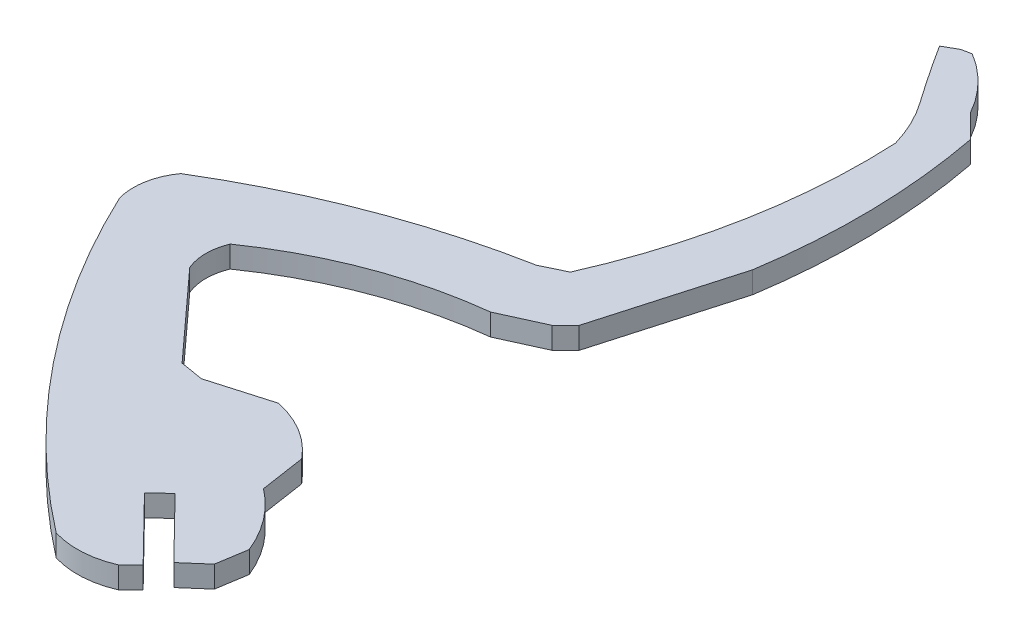
ISO-10303-21;
HEADER;
FILE_DESCRIPTION(('STEP AP214'),'2;1');
FILE_NAME('part.step','',(''),(''),'','','');
FILE_SCHEMA(('AUTOMOTIVE_DESIGN { 1 0 10303 214 1 1 1 1 }'));
ENDSEC;
DATA;
#1=APPLICATION_CONTEXT('core data for automotive mechanical design processes');
#2=APPLICATION_PROTOCOL_DEFINITION('international standard','automotive_design',2000,#1);
#3=PRODUCT_CONTEXT('',#1,'mechanical');
#4=PRODUCT('Part','Part','',(#3));
#5=PRODUCT_RELATED_PRODUCT_CATEGORY('part','',(#4));
#6=PRODUCT_DEFINITION_FORMATION('','',#4);
#7=PRODUCT_DEFINITION_CONTEXT('part definition',#1,'design');
#8=PRODUCT_DEFINITION('design','',#6,#7);
#9=PRODUCT_DEFINITION_SHAPE('','',#8);
#10=(LENGTH_UNIT() NAMED_UNIT(*) SI_UNIT(.MILLI.,.METRE.));
#11=(NAMED_UNIT(*) PLANE_ANGLE_UNIT() SI_UNIT($,.RADIAN.));
#12=(NAMED_UNIT(*) SI_UNIT($,.STERADIAN.) SOLID_ANGLE_UNIT());
#13=UNCERTAINTY_MEASURE_WITH_UNIT(LENGTH_MEASURE(1.E-05),#10,'distance_accuracy_value','');
#14=(GEOMETRIC_REPRESENTATION_CONTEXT(3) GLOBAL_UNCERTAINTY_ASSIGNED_CONTEXT((#13)) GLOBAL_UNIT_ASSIGNED_CONTEXT((#10,
#11,#12)) REPRESENTATION_CONTEXT('',''));
#15=CARTESIAN_POINT('',(0.,0.,0.));
#16=DIRECTION('',(0.,0.,1.));
#17=DIRECTION('',(1.,0.,0.));
#18=AXIS2_PLACEMENT_3D('',#15,#16,#17);
#19=CARTESIAN_POINT('',(-7.41712116409151,2.,-632.365573769868));
#20=DIRECTION('',(0.,-1.,0.));
#21=DIRECTION('',(0.,0.,-1.));
#22=AXIS2_PLACEMENT_3D('',#19,#20,#21);
#23=CYLINDRICAL_SURFACE('',#22,5.65555182550003);
#24=CARTESIAN_POINT('',(-7.41712116409151,0.,-632.365573769868));
#25=DIRECTION('',(0.,1.,0.));
#26=DIRECTION('',(0.,0.,1.));
#27=AXIS2_PLACEMENT_3D('',#24,#25,#26);
#28=CIRCLE('',#27,5.65555182550003);
#29=CARTESIAN_POINT('',(-12.0037899999994,0.,-635.674310000006));
#30=VERTEX_POINT('',#29);
#31=CARTESIAN_POINT('',(-12.8890900000413,0.,-630.936299999972));
#32=VERTEX_POINT('',#31);
#33=EDGE_CURVE('E11',#30,#32,#28,.T.);
#34=ORIENTED_EDGE('',*,*,#33,.T.);
#35=DIRECTION('',(0.,-1.,0.));
#36=VECTOR('',#35,1.);
#37=CARTESIAN_POINT('',(-12.8890900000413,2.,-630.936299999972));
#38=LINE('',#37,#36);
#39=CARTESIAN_POINT('',(-12.8890900000413,2.,-630.936299999972));
#40=VERTEX_POINT('',#39);
#41=EDGE_CURVE('E576',#40,#32,#38,.T.);
#42=ORIENTED_EDGE('',*,*,#41,.F.);
#43=CARTESIAN_POINT('',(-7.41712116409151,2.,-632.365573769868));
#44=DIRECTION('',(0.,1.,0.));
#45=DIRECTION('',(0.,0.,1.));
#46=AXIS2_PLACEMENT_3D('',#43,#44,#45);
#47=CIRCLE('',#46,5.65555182550003);
#48=CARTESIAN_POINT('',(-12.0037899999994,2.,-635.674310000006));
#49=VERTEX_POINT('',#48);
#50=EDGE_CURVE('E41',#49,#40,#47,.T.);
#51=ORIENTED_EDGE('',*,*,#50,.F.);
#52=DIRECTION('',(0.,-1.,0.));
#53=VECTOR('',#52,1.);
#54=CARTESIAN_POINT('',(-12.0037899999994,2.,-635.674310000006));
#55=LINE('',#54,#53);
#56=EDGE_CURVE('E273',#49,#30,#55,.T.);
#57=ORIENTED_EDGE('',*,*,#56,.T.);
#58=EDGE_LOOP('',(#34,#42,#51,#57));
#59=FACE_BOUND('',#58,.T.);
#60=ADVANCED_FACE('F37',(#59),#23,.T.);
#61=CARTESIAN_POINT('',(60.3970241386918,2.,-665.307077304684));
#62=DIRECTION('',(0.,-1.,0.));
#63=DIRECTION('',(0.,0.,-1.));
#64=AXIS2_PLACEMENT_3D('',#61,#62,#63);
#65=CYLINDRICAL_SURFACE('',#64,80.9456907938);
#66=CARTESIAN_POINT('',(60.3970241386918,0.,-665.307077304684));
#67=DIRECTION('',(0.,1.,0.));
#68=DIRECTION('',(0.,0.,1.));
#69=AXIS2_PLACEMENT_3D('',#66,#67,#68);
#70=CIRCLE('',#69,80.9456907938);
#71=CARTESIAN_POINT('',(10.9651200000634,0.,-601.207999999976));
#72=VERTEX_POINT('',#71);
#73=EDGE_CURVE('E47',#32,#72,#70,.T.);
#74=ORIENTED_EDGE('',*,*,#73,.T.);
#75=DIRECTION('',(0.,-1.,0.));
#76=VECTOR('',#75,1.);
#77=CARTESIAN_POINT('',(10.9651200000634,2.,-601.207999999976));
#78=LINE('',#77,#76);
#79=CARTESIAN_POINT('',(10.9651200000634,2.,-601.207999999976));
#80=VERTEX_POINT('',#79);
#81=EDGE_CURVE('E249',#80,#72,#78,.T.);
#82=ORIENTED_EDGE('',*,*,#81,.F.);
#83=CARTESIAN_POINT('',(60.3970241386918,2.,-665.307077304684));
#84=DIRECTION('',(0.,1.,0.));
#85=DIRECTION('',(0.,0.,1.));
#86=AXIS2_PLACEMENT_3D('',#83,#84,#85);
#87=CIRCLE('',#86,80.9456907938);
#88=EDGE_CURVE('E149',#40,#80,#87,.T.);
#89=ORIENTED_EDGE('',*,*,#88,.F.);
#90=ORIENTED_EDGE('',*,*,#41,.T.);
#91=EDGE_LOOP('',(#74,#82,#89,#90));
#92=FACE_BOUND('',#91,.T.);
#93=ADVANCED_FACE('F577',(#92),#65,.T.);
#94=CARTESIAN_POINT('',(13.2541401092692,2.,-608.74506000633));
#95=DIRECTION('',(0.,-1.,0.));
#96=DIRECTION('',(0.,0.,-1.));
#97=AXIS2_PLACEMENT_3D('',#94,#95,#96);
#98=CYLINDRICAL_SURFACE('',#97,7.87698461340009);
#99=CARTESIAN_POINT('',(13.2541401092692,0.,-608.74506000633));
#100=DIRECTION('',(0.,1.,0.));
#101=DIRECTION('',(0.,0.,1.));
#102=AXIS2_PLACEMENT_3D('',#99,#100,#101);
#103=CIRCLE('',#102,7.87698461340009);
#104=CARTESIAN_POINT('',(16.4009799999685,0.,-601.523959999957));
#105=VERTEX_POINT('',#104);
#106=EDGE_CURVE('E243',#72,#105,#103,.T.);
#107=ORIENTED_EDGE('',*,*,#106,.T.);
#108=DIRECTION('',(0.,-1.,0.));
#109=VECTOR('',#108,1.);
#110=CARTESIAN_POINT('',(16.4009799999685,2.,-601.523959999957));
#111=LINE('',#110,#109);
#112=CARTESIAN_POINT('',(16.4009799999685,2.,-601.523959999957));
#113=VERTEX_POINT('',#112);
#114=EDGE_CURVE('E247',#113,#105,#111,.T.);
#115=ORIENTED_EDGE('',*,*,#114,.F.);
#116=CARTESIAN_POINT('',(13.2541401092692,2.,-608.74506000633));
#117=DIRECTION('',(0.,1.,0.));
#118=DIRECTION('',(0.,0.,1.));
#119=AXIS2_PLACEMENT_3D('',#116,#117,#118);
#120=CIRCLE('',#119,7.87698461340009);
#121=EDGE_CURVE('E328',#80,#113,#120,.T.);
#122=ORIENTED_EDGE('',*,*,#121,.F.);
#123=ORIENTED_EDGE('',*,*,#81,.T.);
#124=EDGE_LOOP('',(#107,#115,#122,#123));
#125=FACE_BOUND('',#124,.T.);
#126=ADVANCED_FACE('F245',(#125),#98,.T.);
#127=CARTESIAN_POINT('',(-269.617106965875,2.,-315.709467880077));
#128=DIRECTION('',(-0.70685497861246,0.,-0.707358494124993));
#129=DIRECTION('',(-0.707358494124993,0.,0.70685497861246));
#130=AXIS2_PLACEMENT_3D('',#127,#128,#129);
#131=PLANE('',#130);
#132=DIRECTION('',(0.707358494124993,0.,-0.70685497861246));
#133=VECTOR('',#132,1.);
#134=CARTESIAN_POINT('',(-269.617106965875,0.,-315.709467880077));
#135=LINE('',#134,#133);
#136=CARTESIAN_POINT('',(17.5389,0.,-602.66107));
#137=VERTEX_POINT('',#136);
#138=EDGE_CURVE('E251',#105,#137,#135,.T.);
#139=ORIENTED_EDGE('',*,*,#138,.T.);
#140=DIRECTION('',(0.,-1.,0.));
#141=VECTOR('',#140,1.);
#142=CARTESIAN_POINT('',(17.5389,2.,-602.66107));
#143=LINE('',#142,#141);
#144=CARTESIAN_POINT('',(17.5389,2.,-602.66107));
#145=VERTEX_POINT('',#144);
#146=EDGE_CURVE('E258',#145,#137,#143,.T.);
#147=ORIENTED_EDGE('',*,*,#146,.F.);
#148=DIRECTION('',(0.707358494124993,0.,-0.70685497861246));
#149=VECTOR('',#148,1.);
#150=CARTESIAN_POINT('',(-269.617106965875,2.,-315.709467880077));
#151=LINE('',#150,#149);
#152=EDGE_CURVE('E257',#113,#145,#151,.T.);
#153=ORIENTED_EDGE('',*,*,#152,.F.);
#154=ORIENTED_EDGE('',*,*,#114,.T.);
#155=EDGE_LOOP('',(#139,#147,#153,#154));
#156=FACE_BOUND('',#155,.T.);
#157=ADVANCED_FACE('F254',(#156),#131,.F.);
#158=CARTESIAN_POINT('',(-233.121226608916,2.,-858.720331070032));
#159=DIRECTION('',(-0.714600495511536,0.,0.699532795381794));
#160=DIRECTION('',(0.699532795381794,0.,0.714600495511536));
#161=AXIS2_PLACEMENT_3D('',#158,#159,#160);
#162=PLANE('',#161);
#163=DIRECTION('',(-0.699532795381794,0.,-0.714600495511536));
#164=VECTOR('',#163,1.);
#165=CARTESIAN_POINT('',(-233.121226608916,0.,-858.720331070032));
#166=LINE('',#165,#164);
#167=CARTESIAN_POINT('',(11.8498600000001,0.,-608.47265));
#168=VERTEX_POINT('',#167);
#169=EDGE_CURVE('E263',#137,#168,#166,.T.);
#170=ORIENTED_EDGE('',*,*,#169,.T.);
#171=DIRECTION('',(0.,-1.,0.));
#172=VECTOR('',#171,1.);
#173=CARTESIAN_POINT('',(11.8498600000001,2.,-608.47265));
#174=LINE('',#173,#172);
#175=CARTESIAN_POINT('',(11.8498600000001,2.,-608.47265));
#176=VERTEX_POINT('',#175);
#177=EDGE_CURVE('E395',#176,#168,#174,.T.);
#178=ORIENTED_EDGE('',*,*,#177,.F.);
#179=DIRECTION('',(-0.699532795381794,0.,-0.714600495511536));
#180=VECTOR('',#179,1.);
#181=CARTESIAN_POINT('',(-233.121226608916,2.,-858.720331070032));
#182=LINE('',#181,#180);
#183=EDGE_CURVE('E325',#145,#176,#182,.T.);
#184=ORIENTED_EDGE('',*,*,#183,.F.);
#185=ORIENTED_EDGE('',*,*,#146,.T.);
#186=EDGE_LOOP('',(#170,#178,#184,#185));
#187=FACE_BOUND('',#186,.T.);
#188=ADVANCED_FACE('F571',(#187),#162,.F.);
#189=CARTESIAN_POINT('',(-288.037886309295,2.,-322.628257675503));
#190=DIRECTION('',(-0.689955105026955,0.,-0.723852162424928));
#191=DIRECTION('',(-0.723852162424928,0.,0.689955105026955));
#192=AXIS2_PLACEMENT_3D('',#189,#190,#191);
#193=PLANE('',#192);
#194=DIRECTION('',(0.723852162424928,0.,-0.689955105026955));
#195=VECTOR('',#194,1.);
#196=CARTESIAN_POINT('',(-288.037886309295,0.,-322.628257675503));
#197=LINE('',#196,#195);
#198=CARTESIAN_POINT('',(13.29769,0.,-609.85268));
#199=VERTEX_POINT('',#198);
#200=EDGE_CURVE('E265',#168,#199,#197,.T.);
#201=ORIENTED_EDGE('',*,*,#200,.T.);
#202=DIRECTION('',(0.,-1.,0.));
#203=VECTOR('',#202,1.);
#204=CARTESIAN_POINT('',(13.29769,2.,-609.85268));
#205=LINE('',#204,#203);
#206=CARTESIAN_POINT('',(13.29769,2.,-609.85268));
#207=VERTEX_POINT('',#206);
#208=EDGE_CURVE('E392',#207,#199,#205,.T.);
#209=ORIENTED_EDGE('',*,*,#208,.F.);
#210=DIRECTION('',(0.723852162424928,0.,-0.689955105026955));
#211=VECTOR('',#210,1.);
#212=CARTESIAN_POINT('',(-288.037886309295,2.,-322.628257675503));
#213=LINE('',#212,#211);
#214=EDGE_CURVE('E323',#176,#207,#213,.T.);
#215=ORIENTED_EDGE('',*,*,#214,.F.);
#216=ORIENTED_EDGE('',*,*,#177,.T.);
#217=EDGE_LOOP('',(#201,#209,#215,#216));
#218=FACE_BOUND('',#217,.T.);
#219=ADVANCED_FACE('F390',(#218),#193,.F.);
#220=CARTESIAN_POINT('',(-231.692271920994,2.,-860.119416323499));
#221=DIRECTION('',(0.714600178856164,0.,-0.699533118857669));
#222=DIRECTION('',(-0.69953311885767,0.,-0.714600178856164));
#223=AXIS2_PLACEMENT_3D('',#220,#221,#222);
#224=PLANE('',#223);
#225=DIRECTION('',(0.69953311885767,0.,0.714600178856164));
#226=VECTOR('',#225,1.);
#227=CARTESIAN_POINT('',(-231.692271920994,0.,-860.119416323499));
#228=LINE('',#227,#226);
#229=CARTESIAN_POINT('',(18.7673700000001,0.,-604.26519));
#230=VERTEX_POINT('',#229);
#231=EDGE_CURVE('E385',#199,#230,#228,.T.);
#232=ORIENTED_EDGE('',*,*,#231,.T.);
#233=DIRECTION('',(0.,-1.,0.));
#234=VECTOR('',#233,1.);
#235=CARTESIAN_POINT('',(18.7673700000001,2.,-604.26519));
#236=LINE('',#235,#234);
#237=CARTESIAN_POINT('',(18.7673700000001,2.,-604.26519));
#238=VERTEX_POINT('',#237);
#239=EDGE_CURVE('E401',#238,#230,#236,.T.);
#240=ORIENTED_EDGE('',*,*,#239,.F.);
#241=DIRECTION('',(0.69953311885767,0.,0.714600178856164));
#242=VECTOR('',#241,1.);
#243=CARTESIAN_POINT('',(-231.692271920994,2.,-860.119416323499));
#244=LINE('',#243,#242);
#245=EDGE_CURVE('E321',#207,#238,#244,.T.);
#246=ORIENTED_EDGE('',*,*,#245,.F.);
#247=ORIENTED_EDGE('',*,*,#208,.T.);
#248=EDGE_LOOP('',(#232,#240,#246,#247));
#249=FACE_BOUND('',#248,.T.);
#250=ADVANCED_FACE('F398',(#249),#224,.F.);
#251=CARTESIAN_POINT('',(-305.899341705349,2.,-320.483049296611));
#252=DIRECTION('',(-0.65810886303798,0.,-0.752922787801549));
#253=DIRECTION('',(-0.752922787801549,0.,0.65810886303798));
#254=AXIS2_PLACEMENT_3D('',#251,#252,#253);
#255=PLANE('',#254);
#256=DIRECTION('',(0.752922787801549,0.,-0.65810886303798));
#257=VECTOR('',#256,1.);
#258=CARTESIAN_POINT('',(-305.899341705349,0.,-320.483049296611));
#259=LINE('',#258,#257);
#260=CARTESIAN_POINT('',(20.76264,0.,-606.0092));
#261=VERTEX_POINT('',#260);
#262=EDGE_CURVE('E383',#230,#261,#259,.T.);
#263=ORIENTED_EDGE('',*,*,#262,.T.);
#264=DIRECTION('',(0.,-1.,0.));
#265=VECTOR('',#264,1.);
#266=CARTESIAN_POINT('',(20.76264,2.,-606.0092));
#267=LINE('',#266,#265);
#268=CARTESIAN_POINT('',(20.76264,2.,-606.0092));
#269=VERTEX_POINT('',#268);
#270=EDGE_CURVE('E411',#269,#261,#267,.T.);
#271=ORIENTED_EDGE('',*,*,#270,.F.);
#272=DIRECTION('',(0.752922787801549,0.,-0.65810886303798));
#273=VECTOR('',#272,1.);
#274=CARTESIAN_POINT('',(-305.899341705349,2.,-320.483049296611));
#275=LINE('',#274,#273);
#276=EDGE_CURVE('E319',#238,#269,#275,.T.);
#277=ORIENTED_EDGE('',*,*,#276,.F.);
#278=ORIENTED_EDGE('',*,*,#239,.T.);
#279=EDGE_LOOP('',(#263,#271,#277,#278));
#280=FACE_BOUND('',#279,.T.);
#281=ADVANCED_FACE('F409',(#280),#255,.F.);
#282=CARTESIAN_POINT('',(1.98100709377635,2.,-488.078875102483));
#283=DIRECTION('',(-0.987554318458287,0.,-0.157278314126225));
#284=DIRECTION('',(-0.157278314126225,0.,0.987554318458287));
#285=AXIS2_PLACEMENT_3D('',#282,#283,#284);
#286=PLANE('',#285);
#287=DIRECTION('',(0.157278314126225,0.,-0.987554318458287));
#288=VECTOR('',#287,1.);
#289=CARTESIAN_POINT('',(1.98100709377635,0.,-488.078875102483));
#290=LINE('',#289,#288);
#291=CARTESIAN_POINT('',(21.20529,0.,-608.78861));
#292=VERTEX_POINT('',#291);
#293=EDGE_CURVE('E381',#261,#292,#290,.T.);
#294=ORIENTED_EDGE('',*,*,#293,.T.);
#295=DIRECTION('',(0.,-1.,0.));
#296=VECTOR('',#295,1.);
#297=CARTESIAN_POINT('',(21.20529,2.,-608.78861));
#298=LINE('',#297,#296);
#299=CARTESIAN_POINT('',(21.20529,2.,-608.78861));
#300=VERTEX_POINT('',#299);
#301=EDGE_CURVE('E417',#300,#292,#298,.T.);
#302=ORIENTED_EDGE('',*,*,#301,.F.);
#303=DIRECTION('',(0.157278314126225,0.,-0.987554318458287));
#304=VECTOR('',#303,1.);
#305=CARTESIAN_POINT('',(1.98100709377635,2.,-488.078875102483));
#306=LINE('',#305,#304);
#307=EDGE_CURVE('E317',#269,#300,#306,.T.);
#308=ORIENTED_EDGE('',*,*,#307,.F.);
#309=ORIENTED_EDGE('',*,*,#270,.T.);
#310=EDGE_LOOP('',(#294,#302,#308,#309));
#311=FACE_BOUND('',#310,.T.);
#312=ADVANCED_FACE('F414',(#311),#286,.F.);
#313=CARTESIAN_POINT('',(9.06553161632329,2.,-603.896127879082));
#314=DIRECTION('',(0.,-1.,0.));
#315=DIRECTION('',(0.,0.,-1.));
#316=AXIS2_PLACEMENT_3D('',#313,#314,#315);
#317=CYLINDRICAL_SURFACE('',#316,13.0885489997);
#318=CARTESIAN_POINT('',(9.06553161632329,0.,-603.896127879082));
#319=DIRECTION('',(0.,1.,0.));
#320=DIRECTION('',(0.,0.,1.));
#321=AXIS2_PLACEMENT_3D('',#318,#319,#320);
#322=CIRCLE('',#321,13.0885489997);
#323=CARTESIAN_POINT('',(17.0021199999968,0.,-614.303849999974));
#324=VERTEX_POINT('',#323);
#325=EDGE_CURVE('E379',#292,#324,#322,.T.);
#326=ORIENTED_EDGE('',*,*,#325,.T.);
#327=DIRECTION('',(0.,-1.,0.));
#328=VECTOR('',#327,1.);
#329=CARTESIAN_POINT('',(17.0021199999968,2.,-614.303849999974));
#330=LINE('',#329,#328);
#331=CARTESIAN_POINT('',(17.0021199999968,2.,-614.303849999974));
#332=VERTEX_POINT('',#331);
#333=EDGE_CURVE('E419',#332,#324,#330,.T.);
#334=ORIENTED_EDGE('',*,*,#333,.F.);
#335=CARTESIAN_POINT('',(9.06553161632329,2.,-603.896127879082));
#336=DIRECTION('',(0.,1.,0.));
#337=DIRECTION('',(0.,0.,1.));
#338=AXIS2_PLACEMENT_3D('',#335,#336,#337);
#339=CIRCLE('',#338,13.0885489997);
#340=EDGE_CURVE('E315',#300,#332,#339,.T.);
#341=ORIENTED_EDGE('',*,*,#340,.F.);
#342=ORIENTED_EDGE('',*,*,#301,.T.);
#343=EDGE_LOOP('',(#326,#334,#341,#342));
#344=FACE_BOUND('',#343,.T.);
#345=ADVANCED_FACE('F568',(#344),#317,.T.);
#346=CARTESIAN_POINT('',(11.2084777681841,2.,-652.856342310851));
#347=DIRECTION('',(-0.988895795304989,0.,0.14861058518192));
#348=DIRECTION('',(0.14861058518192,0.,0.988895795304989));
#349=AXIS2_PLACEMENT_3D('',#346,#347,#348);
#350=PLANE('',#349);
#351=DIRECTION('',(-0.14861058518192,0.,-0.988895795304989));
#352=VECTOR('',#351,1.);
#353=CARTESIAN_POINT('',(11.2084777681841,0.,-652.856342310851));
#354=LINE('',#353,#352);
#355=CARTESIAN_POINT('',(16.3788200000001,0.,-618.45146));
#356=VERTEX_POINT('',#355);
#357=EDGE_CURVE('E377',#324,#356,#354,.T.);
#358=ORIENTED_EDGE('',*,*,#357,.T.);
#359=DIRECTION('',(0.,-1.,0.));
#360=VECTOR('',#359,1.);
#361=CARTESIAN_POINT('',(16.3788200000001,2.,-618.45146));
#362=LINE('',#361,#360);
#363=CARTESIAN_POINT('',(16.3788200000001,2.,-618.45146));
#364=VERTEX_POINT('',#363);
#365=EDGE_CURVE('E425',#364,#356,#362,.T.);
#366=ORIENTED_EDGE('',*,*,#365,.F.);
#367=DIRECTION('',(-0.14861058518192,0.,-0.988895795304989));
#368=VECTOR('',#367,1.);
#369=CARTESIAN_POINT('',(11.2084777681841,2.,-652.856342310851));
#370=LINE('',#369,#368);
#371=EDGE_CURVE('E313',#332,#364,#370,.T.);
#372=ORIENTED_EDGE('',*,*,#371,.F.);
#373=ORIENTED_EDGE('',*,*,#333,.T.);
#374=EDGE_LOOP('',(#358,#366,#372,#373));
#375=FACE_BOUND('',#374,.T.);
#376=ADVANCED_FACE('F564',(#375),#350,.F.);
#377=CARTESIAN_POINT('',(8.89434167467395,2.,-612.425588974205));
#378=DIRECTION('',(0.,-1.,0.));
#379=DIRECTION('',(0.,0.,-1.));
#380=AXIS2_PLACEMENT_3D('',#377,#378,#379);
#381=CYLINDRICAL_SURFACE('',#380,9.60877398120005);
#382=CARTESIAN_POINT('',(8.89434167467395,0.,-612.425588974205));
#383=DIRECTION('',(0.,1.,0.));
#384=DIRECTION('',(0.,0.,1.));
#385=AXIS2_PLACEMENT_3D('',#382,#383,#384);
#386=CIRCLE('',#385,9.60877398120005);
#387=CARTESIAN_POINT('',(10.8615200000106,0.,-621.830839999995));
#388=VERTEX_POINT('',#387);
#389=EDGE_CURVE('E375',#356,#388,#386,.T.);
#390=ORIENTED_EDGE('',*,*,#389,.T.);
#391=DIRECTION('',(0.,-1.,0.));
#392=VECTOR('',#391,1.);
#393=CARTESIAN_POINT('',(10.8615200000106,2.,-621.830839999995));
#394=LINE('',#393,#392);
#395=CARTESIAN_POINT('',(10.8615200000106,2.,-621.830839999995));
#396=VERTEX_POINT('',#395);
#397=EDGE_CURVE('E428',#396,#388,#394,.T.);
#398=ORIENTED_EDGE('',*,*,#397,.F.);
#399=CARTESIAN_POINT('',(8.89434167467395,2.,-612.425588974205));
#400=DIRECTION('',(0.,1.,0.));
#401=DIRECTION('',(0.,0.,1.));
#402=AXIS2_PLACEMENT_3D('',#399,#400,#401);
#403=CIRCLE('',#402,9.60877398120005);
#404=EDGE_CURVE('E311',#364,#396,#403,.T.);
#405=ORIENTED_EDGE('',*,*,#404,.F.);
#406=ORIENTED_EDGE('',*,*,#365,.T.);
#407=EDGE_LOOP('',(#390,#398,#405,#406));
#408=FACE_BOUND('',#407,.T.);
#409=ADVANCED_FACE('F559',(#408),#381,.T.);
#410=CARTESIAN_POINT('',(-497.487342414634,2.,-474.32835066889));
#411=DIRECTION('',(0.278666159923199,0.,0.960388031638076));
#412=DIRECTION('',(0.960388031638076,0.,-0.278666159923199));
#413=AXIS2_PLACEMENT_3D('',#410,#411,#412);
#414=PLANE('',#413);
#415=DIRECTION('',(-0.960388031638076,0.,0.278666159923199));
#416=VECTOR('',#415,1.);
#417=CARTESIAN_POINT('',(-497.487342414634,0.,-474.32835066889));
#418=LINE('',#417,#416);
#419=CARTESIAN_POINT('',(5.34477,0.,-620.2301));
#420=VERTEX_POINT('',#419);
#421=EDGE_CURVE('E373',#388,#420,#418,.T.);
#422=ORIENTED_EDGE('',*,*,#421,.T.);
#423=DIRECTION('',(0.,-1.,0.));
#424=VECTOR('',#423,1.);
#425=CARTESIAN_POINT('',(5.34477,2.,-620.2301));
#426=LINE('',#425,#424);
#427=CARTESIAN_POINT('',(5.34477,2.,-620.2301));
#428=VERTEX_POINT('',#427);
#429=EDGE_CURVE('E431',#428,#420,#426,.T.);
#430=ORIENTED_EDGE('',*,*,#429,.F.);
#431=DIRECTION('',(-0.960388031638076,0.,0.278666159923199));
#432=VECTOR('',#431,1.);
#433=CARTESIAN_POINT('',(-497.487342414634,2.,-474.32835066889));
#434=LINE('',#433,#432);
#435=EDGE_CURVE('E309',#396,#428,#434,.T.);
#436=ORIENTED_EDGE('',*,*,#435,.F.);
#437=ORIENTED_EDGE('',*,*,#397,.T.);
#438=EDGE_LOOP('',(#422,#430,#436,#437));
#439=FACE_BOUND('',#438,.T.);
#440=ADVANCED_FACE('F554',(#439),#414,.F.);
#441=CARTESIAN_POINT('',(-503.729289510095,2.,-705.041213315119));
#442=DIRECTION('',(-0.164333825637548,0.,0.986404781898044));
#443=DIRECTION('',(0.986404781898044,0.,0.164333825637548));
#444=AXIS2_PLACEMENT_3D('',#441,#442,#443);
#445=PLANE('',#444);
#446=DIRECTION('',(-0.986404781898044,0.,-0.164333825637548));
#447=VECTOR('',#446,1.);
#448=CARTESIAN_POINT('',(-503.729289510095,0.,-705.041213315119));
#449=LINE('',#448,#447);
#450=CARTESIAN_POINT('',(3.20910000000008,0.,-620.5859));
#451=VERTEX_POINT('',#450);
#452=EDGE_CURVE('E371',#420,#451,#449,.T.);
#453=ORIENTED_EDGE('',*,*,#452,.T.);
#454=DIRECTION('',(0.,-1.,0.));
#455=VECTOR('',#454,1.);
#456=CARTESIAN_POINT('',(3.20910000000008,2.,-620.5859));
#457=LINE('',#456,#455);
#458=CARTESIAN_POINT('',(3.20910000000008,2.,-620.5859));
#459=VERTEX_POINT('',#458);
#460=EDGE_CURVE('E434',#459,#451,#457,.T.);
#461=ORIENTED_EDGE('',*,*,#460,.F.);
#462=DIRECTION('',(-0.986404781898044,0.,-0.164333825637548));
#463=VECTOR('',#462,1.);
#464=CARTESIAN_POINT('',(-503.729289510095,2.,-705.041213315119));
#465=LINE('',#464,#463);
#466=EDGE_CURVE('E307',#428,#459,#465,.T.);
#467=ORIENTED_EDGE('',*,*,#466,.F.);
#468=ORIENTED_EDGE('',*,*,#429,.T.);
#469=EDGE_LOOP('',(#453,#461,#467,#468));
#470=FACE_BOUND('',#469,.T.);
#471=ADVANCED_FACE('F550',(#470),#445,.F.);
#472=CARTESIAN_POINT('',(-212.849771252711,2.,-857.549807030321));
#473=DIRECTION('',(-0.738950341165049,0.,0.673759892908488));
#474=DIRECTION('',(0.673759892908488,0.,0.738950341165049));
#475=AXIS2_PLACEMENT_3D('',#472,#473,#474);
#476=PLANE('',#475);
#477=DIRECTION('',(-0.673759892908488,0.,-0.738950341165049));
#478=VECTOR('',#477,1.);
#479=CARTESIAN_POINT('',(-212.849771252711,0.,-857.549807030321));
#480=LINE('',#479,#478);
#481=CARTESIAN_POINT('',(-4.08821000002019,0.,-628.589269999993));
#482=VERTEX_POINT('',#481);
#483=EDGE_CURVE('E368',#451,#482,#480,.T.);
#484=ORIENTED_EDGE('',*,*,#483,.T.);
#485=DIRECTION('',(0.,-1.,0.));
#486=VECTOR('',#485,1.);
#487=CARTESIAN_POINT('',(-4.08821000002019,2.,-628.589269999993));
#488=LINE('',#487,#486);
#489=CARTESIAN_POINT('',(-4.08821000002019,2.,-628.589269999993));
#490=VERTEX_POINT('',#489);
#491=EDGE_CURVE('E437',#490,#482,#488,.T.);
#492=ORIENTED_EDGE('',*,*,#491,.F.);
#493=DIRECTION('',(-0.673759892908488,0.,-0.738950341165049));
#494=VECTOR('',#493,1.);
#495=CARTESIAN_POINT('',(-212.849771252711,2.,-857.549807030321));
#496=LINE('',#495,#494);
#497=EDGE_CURVE('E305',#459,#490,#496,.T.);
#498=ORIENTED_EDGE('',*,*,#497,.F.);
#499=ORIENTED_EDGE('',*,*,#460,.T.);
#500=EDGE_LOOP('',(#484,#492,#498,#499));
#501=FACE_BOUND('',#500,.T.);
#502=ADVANCED_FACE('F545',(#501),#476,.F.);
#503=CARTESIAN_POINT('',(0.359180000054383,2.,-630.456864999871));
#504=DIRECTION('',(0.,-1.,0.));
#505=DIRECTION('',(0.,0.,-1.));
#506=AXIS2_PLACEMENT_3D('',#503,#504,#505);
#507=CYLINDRICAL_SURFACE('',#506,4.82360745670001);
#508=CARTESIAN_POINT('',(0.359180000054383,0.,-630.456864999871));
#509=DIRECTION('',(0.,1.,0.));
#510=DIRECTION('',(0.,0.,1.));
#511=AXIS2_PLACEMENT_3D('',#508,#509,#510);
#512=CIRCLE('',#511,4.82360745670001);
#513=CARTESIAN_POINT('',(-4.08820999994245,0.,-632.324459999933));
#514=VERTEX_POINT('',#513);
#515=EDGE_CURVE('E365',#514,#482,#512,.T.);
#516=ORIENTED_EDGE('',*,*,#515,.F.);
#517=DIRECTION('',(0.,-1.,0.));
#518=VECTOR('',#517,1.);
#519=CARTESIAN_POINT('',(-4.08820999994245,2.,-632.324459999933));
#520=LINE('',#519,#518);
#521=CARTESIAN_POINT('',(-4.08820999994245,2.,-632.324459999933));
#522=VERTEX_POINT('',#521);
#523=EDGE_CURVE('E439',#522,#514,#520,.T.);
#524=ORIENTED_EDGE('',*,*,#523,.F.);
#525=CARTESIAN_POINT('',(0.359180000054383,2.,-630.456864999871));
#526=DIRECTION('',(0.,1.,0.));
#527=DIRECTION('',(0.,0.,1.));
#528=AXIS2_PLACEMENT_3D('',#525,#526,#527);
#529=CIRCLE('',#528,4.82360745670001);
#530=EDGE_CURVE('E302',#522,#490,#529,.T.);
#531=ORIENTED_EDGE('',*,*,#530,.T.);
#532=ORIENTED_EDGE('',*,*,#491,.T.);
#533=EDGE_LOOP('',(#516,#524,#531,#532));
#534=FACE_BOUND('',#533,.T.);
#535=ADVANCED_FACE('F539',(#534),#507,.F.);
#536=CARTESIAN_POINT('',(17.6873382143,2.,-601.0132830991));
#537=DIRECTION('',(0.,-1.,0.));
#538=DIRECTION('',(0.,0.,-1.));
#539=AXIS2_PLACEMENT_3D('',#536,#537,#538);
#540=CYLINDRICAL_SURFACE('',#539,38.1387506212);
#541=CARTESIAN_POINT('',(17.6873382143,0.,-601.0132830991));
#542=DIRECTION('',(0.,1.,0.));
#543=DIRECTION('',(0.,0.,1.));
#544=AXIS2_PLACEMENT_3D('',#541,#542,#543);
#545=CIRCLE('',#544,38.1387506212);
#546=CARTESIAN_POINT('',(13.3534200000389,0.,-638.904989999927));
#547=VERTEX_POINT('',#546);
#548=EDGE_CURVE('E362',#547,#514,#545,.T.);
#549=ORIENTED_EDGE('',*,*,#548,.F.);
#550=DIRECTION('',(0.,-1.,0.));
#551=VECTOR('',#550,1.);
#552=CARTESIAN_POINT('',(13.3534200000389,2.,-638.904989999927));
#553=LINE('',#552,#551);
#554=CARTESIAN_POINT('',(13.3534200000389,2.,-638.904989999927));
#555=VERTEX_POINT('',#554);
#556=EDGE_CURVE('E441',#555,#547,#553,.T.);
#557=ORIENTED_EDGE('',*,*,#556,.F.);
#558=CARTESIAN_POINT('',(17.6873382143,2.,-601.0132830991));
#559=DIRECTION('',(0.,1.,0.));
#560=DIRECTION('',(0.,0.,1.));
#561=AXIS2_PLACEMENT_3D('',#558,#559,#560);
#562=CIRCLE('',#561,38.1387506212);
#563=EDGE_CURVE('E299',#555,#522,#562,.T.);
#564=ORIENTED_EDGE('',*,*,#563,.T.);
#565=ORIENTED_EDGE('',*,*,#523,.T.);
#566=EDGE_LOOP('',(#549,#557,#564,#565));
#567=FACE_BOUND('',#566,.T.);
#568=ADVANCED_FACE('F535',(#567),#540,.F.);
#569=CARTESIAN_POINT('',(-458.779572818498,2.,-424.445527942357));
#570=DIRECTION('',(-0.413568882022288,0.,-0.910472833105324));
#571=DIRECTION('',(-0.910472833105324,0.,0.413568882022288));
#572=AXIS2_PLACEMENT_3D('',#569,#570,#571);
#573=PLANE('',#572);
#574=DIRECTION('',(0.910472833105324,0.,-0.413568882022288));
#575=VECTOR('',#574,1.);
#576=CARTESIAN_POINT('',(-458.779572818498,0.,-424.445527942357));
#577=LINE('',#576,#575);
#578=CARTESIAN_POINT('',(17.2691000000001,0.,-640.68363));
#579=VERTEX_POINT('',#578);
#580=EDGE_CURVE('E360',#547,#579,#577,.T.);
#581=ORIENTED_EDGE('',*,*,#580,.T.);
#582=DIRECTION('',(0.,-1.,0.));
#583=VECTOR('',#582,1.);
#584=CARTESIAN_POINT('',(17.2691000000001,2.,-640.68363));
#585=LINE('',#584,#583);
#586=CARTESIAN_POINT('',(17.2691000000001,2.,-640.68363));
#587=VERTEX_POINT('',#586);
#588=EDGE_CURVE('E443',#587,#579,#585,.T.);
#589=ORIENTED_EDGE('',*,*,#588,.F.);
#590=DIRECTION('',(0.910472833105324,0.,-0.413568882022288));
#591=VECTOR('',#590,1.);
#592=CARTESIAN_POINT('',(-458.779572818498,2.,-424.445527942357));
#593=LINE('',#592,#591);
#594=EDGE_CURVE('E297',#555,#587,#593,.T.);
#595=ORIENTED_EDGE('',*,*,#594,.F.);
#596=ORIENTED_EDGE('',*,*,#556,.T.);
#597=EDGE_LOOP('',(#581,#589,#595,#596));
#598=FACE_BOUND('',#597,.T.);
#599=ADVANCED_FACE('F531',(#598),#573,.F.);
#600=CARTESIAN_POINT('',(-288.667957642864,2.,-334.857116500356));
#601=DIRECTION('',(-0.706978997222367,0.,-0.707234542062572));
#602=DIRECTION('',(-0.707234542062572,0.,0.706978997222367));
#603=AXIS2_PLACEMENT_3D('',#600,#601,#602);
#604=PLANE('',#603);
#605=DIRECTION('',(0.707234542062572,0.,-0.706978997222367));
#606=VECTOR('',#605,1.);
#607=CARTESIAN_POINT('',(-288.667957642864,0.,-334.857116500356));
#608=LINE('',#607,#606);
#609=CARTESIAN_POINT('',(18.5145,0.,-641.92858));
#610=VERTEX_POINT('',#609);
#611=EDGE_CURVE('E358',#579,#610,#608,.T.);
#612=ORIENTED_EDGE('',*,*,#611,.T.);
#613=DIRECTION('',(0.,-1.,0.));
#614=VECTOR('',#613,1.);
#615=CARTESIAN_POINT('',(18.5145,2.,-641.92858));
#616=LINE('',#615,#614);
#617=CARTESIAN_POINT('',(18.5145,2.,-641.92858));
#618=VERTEX_POINT('',#617);
#619=EDGE_CURVE('E446',#618,#610,#616,.T.);
#620=ORIENTED_EDGE('',*,*,#619,.F.);
#621=DIRECTION('',(0.707234542062572,0.,-0.706978997222367));
#622=VECTOR('',#621,1.);
#623=CARTESIAN_POINT('',(-288.667957642864,2.,-334.857116500356));
#624=LINE('',#623,#622);
#625=EDGE_CURVE('E295',#587,#618,#624,.T.);
#626=ORIENTED_EDGE('',*,*,#625,.F.);
#627=ORIENTED_EDGE('',*,*,#588,.T.);
#628=EDGE_LOOP('',(#612,#620,#626,#627));
#629=FACE_BOUND('',#628,.T.);
#630=ADVANCED_FACE('F527',(#629),#604,.F.);
#631=CARTESIAN_POINT('',(-75736.9870484763,2.,-22306.9298478529));
#632=DIRECTION('',(0.,-1.,0.));
#633=DIRECTION('',(0.,0.,-1.));
#634=AXIS2_PLACEMENT_3D('',#631,#632,#633);
#635=CYLINDRICAL_SURFACE('',#634,78792.5649715585);
#636=CARTESIAN_POINT('',(-75736.9870484763,0.,-22306.9298478529));
#637=DIRECTION('',(0.,1.,0.));
#638=DIRECTION('',(0.,0.,1.));
#639=AXIS2_PLACEMENT_3D('',#636,#637,#638);
#640=CIRCLE('',#639,78792.5649715585);
#641=CARTESIAN_POINT('',(22.0739600106157,0.,-654.37873003723));
#642=VERTEX_POINT('',#641);
#643=EDGE_CURVE('E356',#610,#642,#640,.T.);
#644=ORIENTED_EDGE('',*,*,#643,.T.);
#645=DIRECTION('',(0.,-1.,0.));
#646=VECTOR('',#645,1.);
#647=CARTESIAN_POINT('',(22.0739600106157,2.,-654.37873003723));
#648=LINE('',#647,#646);
#649=CARTESIAN_POINT('',(22.0739600106157,2.,-654.37873003723));
#650=VERTEX_POINT('',#649);
#651=EDGE_CURVE('E449',#650,#642,#648,.T.);
#652=ORIENTED_EDGE('',*,*,#651,.F.);
#653=CARTESIAN_POINT('',(-75736.9870484763,2.,-22306.9298478529));
#654=DIRECTION('',(0.,1.,0.));
#655=DIRECTION('',(0.,0.,1.));
#656=AXIS2_PLACEMENT_3D('',#653,#654,#655);
#657=CIRCLE('',#656,78792.5649715585);
#658=EDGE_CURVE('E293',#618,#650,#657,.T.);
#659=ORIENTED_EDGE('',*,*,#658,.F.);
#660=ORIENTED_EDGE('',*,*,#619,.T.);
#661=EDGE_LOOP('',(#644,#652,#659,#660));
#662=FACE_BOUND('',#661,.T.);
#663=ADVANCED_FACE('F522',(#662),#635,.T.);
#664=CARTESIAN_POINT('',(-36.9044098625613,2.,-663.58300223197));
#665=DIRECTION('',(0.,-1.,0.));
#666=DIRECTION('',(0.,0.,-1.));
#667=AXIS2_PLACEMENT_3D('',#664,#665,#666);
#668=CYLINDRICAL_SURFACE('',#667,59.6922669993693);
#669=CARTESIAN_POINT('',(-36.9044098625613,0.,-663.58300223197));
#670=DIRECTION('',(0.,1.,0.));
#671=DIRECTION('',(0.,0.,1.));
#672=AXIS2_PLACEMENT_3D('',#669,#670,#671);
#673=CIRCLE('',#672,59.6922669993693);
#674=CARTESIAN_POINT('',(21.7182900000694,0.,-674.832260000002));
#675=VERTEX_POINT('',#674);
#676=EDGE_CURVE('E354',#642,#675,#673,.T.);
#677=ORIENTED_EDGE('',*,*,#676,.T.);
#678=DIRECTION('',(0.,-1.,0.));
#679=VECTOR('',#678,1.);
#680=CARTESIAN_POINT('',(21.7182900000694,2.,-674.832260000002));
#681=LINE('',#680,#679);
#682=CARTESIAN_POINT('',(21.7182900000694,2.,-674.832260000002));
#683=VERTEX_POINT('',#682);
#684=EDGE_CURVE('E452',#683,#675,#681,.T.);
#685=ORIENTED_EDGE('',*,*,#684,.F.);
#686=CARTESIAN_POINT('',(-36.9044098625613,2.,-663.58300223197));
#687=DIRECTION('',(0.,1.,0.));
#688=DIRECTION('',(0.,0.,1.));
#689=AXIS2_PLACEMENT_3D('',#686,#687,#688);
#690=CIRCLE('',#689,59.6922669993693);
#691=EDGE_CURVE('E291',#650,#683,#690,.T.);
#692=ORIENTED_EDGE('',*,*,#691,.F.);
#693=ORIENTED_EDGE('',*,*,#651,.T.);
#694=EDGE_LOOP('',(#677,#685,#692,#693));
#695=FACE_BOUND('',#694,.T.);
#696=ADVANCED_FACE('F516',(#695),#668,.T.);
#697=CARTESIAN_POINT('',(-200.889616636886,2.,-897.311959684972));
#698=DIRECTION('',(-0.706903070598405,0.,0.70731043310455));
#699=DIRECTION('',(0.70731043310455,0.,0.706903070598405));
#700=AXIS2_PLACEMENT_3D('',#697,#698,#699);
#701=PLANE('',#700);
#702=DIRECTION('',(-0.70731043310455,0.,-0.706903070598405));
#703=VECTOR('',#702,1.);
#704=CARTESIAN_POINT('',(-200.889616636886,0.,-897.311959684972));
#705=LINE('',#704,#703);
#706=CARTESIAN_POINT('',(19.58262,0.,-676.9667));
#707=VERTEX_POINT('',#706);
#708=EDGE_CURVE('E352',#675,#707,#705,.T.);
#709=ORIENTED_EDGE('',*,*,#708,.T.);
#710=DIRECTION('',(0.,-1.,0.));
#711=VECTOR('',#710,1.);
#712=CARTESIAN_POINT('',(19.58262,2.,-676.9667));
#713=LINE('',#712,#711);
#714=CARTESIAN_POINT('',(19.58262,2.,-676.9667));
#715=VERTEX_POINT('',#714);
#716=EDGE_CURVE('E455',#715,#707,#713,.T.);
#717=ORIENTED_EDGE('',*,*,#716,.F.);
#718=DIRECTION('',(-0.70731043310455,0.,-0.706903070598405));
#719=VECTOR('',#718,1.);
#720=CARTESIAN_POINT('',(-200.889616636886,2.,-897.311959684972));
#721=LINE('',#720,#719);
#722=EDGE_CURVE('E289',#683,#715,#721,.T.);
#723=ORIENTED_EDGE('',*,*,#722,.F.);
#724=ORIENTED_EDGE('',*,*,#684,.T.);
#725=EDGE_LOOP('',(#709,#717,#723,#724));
#726=FACE_BOUND('',#725,.T.);
#727=ADVANCED_FACE('F512',(#726),#701,.F.);
#728=CARTESIAN_POINT('',(8.33154438705801,2.,-670.754785447685));
#729=DIRECTION('',(0.,-1.,0.));
#730=DIRECTION('',(0.,0.,-1.));
#731=AXIS2_PLACEMENT_3D('',#728,#729,#730);
#732=CYLINDRICAL_SURFACE('',#731,12.8520264882);
#733=CARTESIAN_POINT('',(8.33154438705801,0.,-670.754785447685));
#734=DIRECTION('',(0.,1.,0.));
#735=DIRECTION('',(0.,0.,1.));
#736=AXIS2_PLACEMENT_3D('',#733,#734,#735);
#737=CIRCLE('',#736,12.8520264882);
#738=CARTESIAN_POINT('',(14.9550400000549,0.,-681.768590000065));
#739=VERTEX_POINT('',#738);
#740=EDGE_CURVE('E350',#707,#739,#737,.T.);
#741=ORIENTED_EDGE('',*,*,#740,.T.);
#742=DIRECTION('',(0.,-1.,0.));
#743=VECTOR('',#742,1.);
#744=CARTESIAN_POINT('',(14.9550400000549,2.,-681.768590000065));
#745=LINE('',#744,#743);
#746=CARTESIAN_POINT('',(14.9550400000549,2.,-681.768590000065));
#747=VERTEX_POINT('',#746);
#748=EDGE_CURVE('E458',#747,#739,#745,.T.);
#749=ORIENTED_EDGE('',*,*,#748,.F.);
#750=CARTESIAN_POINT('',(8.33154438705801,2.,-670.754785447685));
#751=DIRECTION('',(0.,1.,0.));
#752=DIRECTION('',(0.,0.,1.));
#753=AXIS2_PLACEMENT_3D('',#750,#751,#752);
#754=CIRCLE('',#753,12.8520264882);
#755=EDGE_CURVE('E287',#715,#747,#754,.T.);
#756=ORIENTED_EDGE('',*,*,#755,.F.);
#757=ORIENTED_EDGE('',*,*,#716,.T.);
#758=EDGE_LOOP('',(#741,#749,#756,#757));
#759=FACE_BOUND('',#758,.T.);
#760=ADVANCED_FACE('F507',(#759),#732,.T.);
#761=CARTESIAN_POINT('',(-526.195905710841,2.,-573.779255662672));
#762=DIRECTION('',(0.195696431624577,0.,0.980664522989084));
#763=DIRECTION('',(0.980664522989084,0.,-0.195696431624577));
#764=AXIS2_PLACEMENT_3D('',#761,#762,#763);
#765=PLANE('',#764);
#766=DIRECTION('',(-0.980664522989084,0.,0.195696431624577));
#767=VECTOR('',#766,1.);
#768=CARTESIAN_POINT('',(-526.195905710841,0.,-573.779255662672));
#769=LINE('',#768,#767);
#770=CARTESIAN_POINT('',(14.0653099999999,0.,-681.59104));
#771=VERTEX_POINT('',#770);
#772=EDGE_CURVE('E348',#739,#771,#769,.T.);
#773=ORIENTED_EDGE('',*,*,#772,.T.);
#774=DIRECTION('',(0.,-1.,0.));
#775=VECTOR('',#774,1.);
#776=CARTESIAN_POINT('',(14.0653099999999,2.,-681.59104));
#777=LINE('',#776,#775);
#778=CARTESIAN_POINT('',(14.0653099999999,2.,-681.59104));
#779=VERTEX_POINT('',#778);
#780=EDGE_CURVE('E461',#779,#771,#777,.T.);
#781=ORIENTED_EDGE('',*,*,#780,.F.);
#782=DIRECTION('',(-0.980664522989084,0.,0.195696431624577));
#783=VECTOR('',#782,1.);
#784=CARTESIAN_POINT('',(-526.195905710841,2.,-573.779255662672));
#785=LINE('',#784,#783);
#786=EDGE_CURVE('E285',#747,#779,#785,.T.);
#787=ORIENTED_EDGE('',*,*,#786,.F.);
#788=ORIENTED_EDGE('',*,*,#748,.T.);
#789=EDGE_LOOP('',(#773,#781,#787,#788));
#790=FACE_BOUND('',#789,.T.);
#791=ADVANCED_FACE('F501',(#790),#765,.F.);
#792=CARTESIAN_POINT('',(-440.200825005846,2.,-422.145812125587));
#793=DIRECTION('',(0.495943782122476,0.,0.868354630881908));
#794=DIRECTION('',(0.868354630881908,0.,-0.495943782122476));
#795=AXIS2_PLACEMENT_3D('',#792,#793,#794);
#796=PLANE('',#795);
#797=DIRECTION('',(-0.868354630881908,0.,0.495943782122476));
#798=VECTOR('',#797,1.);
#799=CARTESIAN_POINT('',(-440.200825005846,0.,-422.145812125587));
#800=LINE('',#799,#798);
#801=CARTESIAN_POINT('',(12.81936,0.,-680.87944));
#802=VERTEX_POINT('',#801);
#803=EDGE_CURVE('E346',#771,#802,#800,.T.);
#804=ORIENTED_EDGE('',*,*,#803,.T.);
#805=DIRECTION('',(0.,-1.,0.));
#806=VECTOR('',#805,1.);
#807=CARTESIAN_POINT('',(12.81936,2.,-680.87944));
#808=LINE('',#807,#806);
#809=CARTESIAN_POINT('',(12.81936,2.,-680.87944));
#810=VERTEX_POINT('',#809);
#811=EDGE_CURVE('E464',#810,#802,#808,.T.);
#812=ORIENTED_EDGE('',*,*,#811,.F.);
#813=DIRECTION('',(-0.868354630881908,0.,0.495943782122476));
#814=VECTOR('',#813,1.);
#815=CARTESIAN_POINT('',(-440.200825005846,2.,-422.145812125587));
#816=LINE('',#815,#814);
#817=EDGE_CURVE('E283',#779,#810,#816,.T.);
#818=ORIENTED_EDGE('',*,*,#817,.F.);
#819=ORIENTED_EDGE('',*,*,#780,.T.);
#820=EDGE_LOOP('',(#804,#812,#818,#819));
#821=FACE_BOUND('',#820,.T.);
#822=ADVANCED_FACE('F497',(#821),#796,.F.);
#823=CARTESIAN_POINT('',(131.011021561356,2.,-755.93411505558));
#824=DIRECTION('',(0.,-1.,0.));
#825=DIRECTION('',(0.,0.,-1.));
#826=AXIS2_PLACEMENT_3D('',#823,#824,#825);
#827=CYLINDRICAL_SURFACE('',#826,140.0088322583);
#828=CARTESIAN_POINT('',(131.011021561356,0.,-755.93411505558));
#829=DIRECTION('',(0.,1.,0.));
#830=DIRECTION('',(0.,0.,1.));
#831=AXIS2_PLACEMENT_3D('',#828,#829,#830);
#832=CIRCLE('',#831,140.0088322583);
#833=CARTESIAN_POINT('',(16.3954400000133,0.,-675.524279999861));
#834=VERTEX_POINT('',#833);
#835=EDGE_CURVE('E343',#802,#834,#832,.T.);
#836=ORIENTED_EDGE('',*,*,#835,.T.);
#837=DIRECTION('',(0.,-1.,0.));
#838=VECTOR('',#837,1.);
#839=CARTESIAN_POINT('',(16.3954400000133,2.,-675.524279999861));
#840=LINE('',#839,#838);
#841=CARTESIAN_POINT('',(16.3954400000133,2.,-675.524279999861));
#842=VERTEX_POINT('',#841);
#843=EDGE_CURVE('E467',#842,#834,#840,.T.);
#844=ORIENTED_EDGE('',*,*,#843,.F.);
#845=CARTESIAN_POINT('',(131.011021561356,2.,-755.93411505558));
#846=DIRECTION('',(0.,1.,0.));
#847=DIRECTION('',(0.,0.,1.));
#848=AXIS2_PLACEMENT_3D('',#845,#846,#847);
#849=CIRCLE('',#848,140.0088322583);
#850=EDGE_CURVE('E281',#810,#842,#849,.T.);
#851=ORIENTED_EDGE('',*,*,#850,.F.);
#852=ORIENTED_EDGE('',*,*,#811,.T.);
#853=EDGE_LOOP('',(#836,#844,#851,#852));
#854=FACE_BOUND('',#853,.T.);
#855=ADVANCED_FACE('F492',(#854),#827,.T.);
#856=CARTESIAN_POINT('',(4.62930189423294,2.,-667.073105524754));
#857=DIRECTION('',(0.,-1.,0.));
#858=DIRECTION('',(0.,0.,-1.));
#859=AXIS2_PLACEMENT_3D('',#856,#857,#858);
#860=CYLINDRICAL_SURFACE('',#859,14.4866958252693);
#861=CARTESIAN_POINT('',(4.62930189423294,0.,-667.073105524754));
#862=DIRECTION('',(0.,1.,0.));
#863=DIRECTION('',(0.,0.,1.));
#864=AXIS2_PLACEMENT_3D('',#861,#862,#863);
#865=CIRCLE('',#864,14.4866958252693);
#866=CARTESIAN_POINT('',(18.5444199999806,0.,-671.102229999993));
#867=VERTEX_POINT('',#866);
#868=EDGE_CURVE('E340',#867,#834,#865,.T.);
#869=ORIENTED_EDGE('',*,*,#868,.F.);
#870=DIRECTION('',(0.,-1.,0.));
#871=VECTOR('',#870,1.);
#872=CARTESIAN_POINT('',(18.5444199999806,2.,-671.102229999993));
#873=LINE('',#872,#871);
#874=CARTESIAN_POINT('',(18.5444199999806,2.,-671.102229999993));
#875=VERTEX_POINT('',#874);
#876=EDGE_CURVE('E469',#875,#867,#873,.T.);
#877=ORIENTED_EDGE('',*,*,#876,.F.);
#878=CARTESIAN_POINT('',(4.62930189423294,2.,-667.073105524754));
#879=DIRECTION('',(0.,1.,0.));
#880=DIRECTION('',(0.,0.,1.));
#881=AXIS2_PLACEMENT_3D('',#878,#879,#880);
#882=CIRCLE('',#881,14.4866958252693);
#883=EDGE_CURVE('E278',#875,#842,#882,.T.);
#884=ORIENTED_EDGE('',*,*,#883,.T.);
#885=ORIENTED_EDGE('',*,*,#843,.T.);
#886=EDGE_LOOP('',(#869,#877,#884,#885));
#887=FACE_BOUND('',#886,.T.);
#888=ADVANCED_FACE('F486',(#887),#860,.F.);
#889=CARTESIAN_POINT('',(-37.0431303259,2.,-668.3129682421));
#890=DIRECTION('',(0.,-1.,0.));
#891=DIRECTION('',(0.,0.,-1.));
#892=AXIS2_PLACEMENT_3D('',#889,#890,#891);
#893=CYLINDRICAL_SURFACE('',#892,55.6574858612);
#894=CARTESIAN_POINT('',(-37.0431303259,0.,-668.3129682421));
#895=DIRECTION('',(0.,1.,0.));
#896=DIRECTION('',(0.,0.,1.));
#897=AXIS2_PLACEMENT_3D('',#894,#895,#896);
#898=CIRCLE('',#897,55.6574858612);
#899=CARTESIAN_POINT('',(13.8498099999949,0.,-645.781559999947));
#900=VERTEX_POINT('',#899);
#901=EDGE_CURVE('E333',#900,#867,#898,.T.);
#902=ORIENTED_EDGE('',*,*,#901,.F.);
#903=DIRECTION('',(0.,-1.,0.));
#904=VECTOR('',#903,1.);
#905=CARTESIAN_POINT('',(13.8498099999949,2.,-645.781559999947));
#906=LINE('',#905,#904);
#907=CARTESIAN_POINT('',(13.8498099999949,2.,-645.781559999947));
#908=VERTEX_POINT('',#907);
#909=EDGE_CURVE('E471',#908,#900,#906,.T.);
#910=ORIENTED_EDGE('',*,*,#909,.F.);
#911=CARTESIAN_POINT('',(-37.0431303259,2.,-668.3129682421));
#912=DIRECTION('',(0.,1.,0.));
#913=DIRECTION('',(0.,0.,1.));
#914=AXIS2_PLACEMENT_3D('',#911,#912,#913);
#915=CIRCLE('',#914,55.6574858612);
#916=EDGE_CURVE('E275',#908,#875,#915,.T.);
#917=ORIENTED_EDGE('',*,*,#916,.T.);
#918=ORIENTED_EDGE('',*,*,#876,.T.);
#919=EDGE_LOOP('',(#902,#910,#917,#918));
#920=FACE_BOUND('',#919,.T.);
#921=ADVANCED_FACE('F480',(#920),#893,.F.);
#922=CARTESIAN_POINT('',(-452.134353317103,2.,-419.978675107797));
#923=DIRECTION('',(0.436072051937831,0.,0.899911754295236));
#924=DIRECTION('',(0.899911754295236,0.,-0.436072051937831));
#925=AXIS2_PLACEMENT_3D('',#922,#923,#924);
#926=PLANE('',#925);
#927=DIRECTION('',(-0.899911754295236,0.,0.436072051937831));
#928=VECTOR('',#927,1.);
#929=CARTESIAN_POINT('',(-452.134353317103,0.,-419.978675107797));
#930=LINE('',#929,#928);
#931=CARTESIAN_POINT('',(11.7639899999999,0.,-644.77083));
#932=VERTEX_POINT('',#931);
#933=EDGE_CURVE('E331',#900,#932,#930,.T.);
#934=ORIENTED_EDGE('',*,*,#933,.T.);
#935=DIRECTION('',(0.,-1.,0.));
#936=VECTOR('',#935,1.);
#937=CARTESIAN_POINT('',(11.7639899999999,2.,-644.77083));
#938=LINE('',#937,#936);
#939=CARTESIAN_POINT('',(11.7639899999999,2.,-644.77083));
#940=VERTEX_POINT('',#939);
#941=EDGE_CURVE('E472',#940,#932,#938,.T.);
#942=ORIENTED_EDGE('',*,*,#941,.F.);
#943=DIRECTION('',(-0.899911754295236,0.,0.436072051937831));
#944=VECTOR('',#943,1.);
#945=CARTESIAN_POINT('',(-452.134353317103,2.,-419.978675107797));
#946=LINE('',#945,#944);
#947=EDGE_CURVE('E272',#908,#940,#946,.T.);
#948=ORIENTED_EDGE('',*,*,#947,.F.);
#949=ORIENTED_EDGE('',*,*,#909,.T.);
#950=EDGE_LOOP('',(#934,#942,#948,#949));
#951=FACE_BOUND('',#950,.T.);
#952=ADVANCED_FACE('F637',(#951),#926,.F.);
#953=CARTESIAN_POINT('',(24.9059589561577,2.,-574.833925773274));
#954=DIRECTION('',(0.,-1.,0.));
#955=DIRECTION('',(0.,0.,-1.));
#956=AXIS2_PLACEMENT_3D('',#953,#954,#955);
#957=CYLINDRICAL_SURFACE('',#956,71.1609578411);
#958=CARTESIAN_POINT('',(24.9059589561577,0.,-574.833925773274));
#959=DIRECTION('',(0.,1.,0.));
#960=DIRECTION('',(0.,0.,1.));
#961=AXIS2_PLACEMENT_3D('',#958,#959,#960);
#962=CIRCLE('',#961,71.1609578411);
#963=EDGE_CURVE('E160',#932,#30,#962,.T.);
#964=ORIENTED_EDGE('',*,*,#963,.T.);
#965=ORIENTED_EDGE('',*,*,#56,.F.);
#966=CARTESIAN_POINT('',(24.9059589561577,2.,-574.833925773274));
#967=DIRECTION('',(0.,1.,0.));
#968=DIRECTION('',(0.,0.,1.));
#969=AXIS2_PLACEMENT_3D('',#966,#967,#968);
#970=CIRCLE('',#969,71.1609578411);
#971=EDGE_CURVE('E270',#940,#49,#970,.T.);
#972=ORIENTED_EDGE('',*,*,#971,.F.);
#973=ORIENTED_EDGE('',*,*,#941,.T.);
#974=EDGE_LOOP('',(#964,#965,#972,#973));
#975=FACE_BOUND('',#974,.T.);
#976=ADVANCED_FACE('F640',(#975),#957,.T.);
#977=CARTESIAN_POINT('',(-525.869702128861,2.,-572.1446));
#978=DIRECTION('',(0.,1.,0.));
#979=DIRECTION('',(0.,0.,1.));
#980=AXIS2_PLACEMENT_3D('',#977,#978,#979);
#981=PLANE('',#980);
#982=ORIENTED_EDGE('',*,*,#50,.T.);
#983=ORIENTED_EDGE('',*,*,#88,.T.);
#984=ORIENTED_EDGE('',*,*,#121,.T.);
#985=ORIENTED_EDGE('',*,*,#152,.T.);
#986=ORIENTED_EDGE('',*,*,#183,.T.);
#987=ORIENTED_EDGE('',*,*,#214,.T.);
#988=ORIENTED_EDGE('',*,*,#245,.T.);
#989=ORIENTED_EDGE('',*,*,#276,.T.);
#990=ORIENTED_EDGE('',*,*,#307,.T.);
#991=ORIENTED_EDGE('',*,*,#340,.T.);
#992=ORIENTED_EDGE('',*,*,#371,.T.);
#993=ORIENTED_EDGE('',*,*,#404,.T.);
#994=ORIENTED_EDGE('',*,*,#435,.T.);
#995=ORIENTED_EDGE('',*,*,#466,.T.);
#996=ORIENTED_EDGE('',*,*,#497,.T.);
#997=ORIENTED_EDGE('',*,*,#530,.F.);
#998=ORIENTED_EDGE('',*,*,#563,.F.);
#999=ORIENTED_EDGE('',*,*,#594,.T.);
#1000=ORIENTED_EDGE('',*,*,#625,.T.);
#1001=ORIENTED_EDGE('',*,*,#658,.T.);
#1002=ORIENTED_EDGE('',*,*,#691,.T.);
#1003=ORIENTED_EDGE('',*,*,#722,.T.);
#1004=ORIENTED_EDGE('',*,*,#755,.T.);
#1005=ORIENTED_EDGE('',*,*,#786,.T.);
#1006=ORIENTED_EDGE('',*,*,#817,.T.);
#1007=ORIENTED_EDGE('',*,*,#850,.T.);
#1008=ORIENTED_EDGE('',*,*,#883,.F.);
#1009=ORIENTED_EDGE('',*,*,#916,.F.);
#1010=ORIENTED_EDGE('',*,*,#947,.T.);
#1011=ORIENTED_EDGE('',*,*,#971,.T.);
#1012=EDGE_LOOP('',(#982,#983,#984,#985,#986,#987,#988,#989,#990,#991,#992,#993,#994,#995,#996,
#997,#998,#999,#1000,#1001,#1002,#1003,#1004,#1005,#1006,#1007,#1008,#1009,#1010,#1011));
#1013=FACE_BOUND('',#1012,.T.);
#1014=ADVANCED_FACE('F39',(#1013),#981,.T.);
#1015=CARTESIAN_POINT('',(-525.869702128861,0.,-572.1446));
#1016=DIRECTION('',(0.,1.,0.));
#1017=DIRECTION('',(0.,0.,1.));
#1018=AXIS2_PLACEMENT_3D('',#1015,#1016,#1017);
#1019=PLANE('',#1018);
#1020=ORIENTED_EDGE('',*,*,#33,.F.);
#1021=ORIENTED_EDGE('',*,*,#963,.F.);
#1022=ORIENTED_EDGE('',*,*,#933,.F.);
#1023=ORIENTED_EDGE('',*,*,#901,.T.);
#1024=ORIENTED_EDGE('',*,*,#868,.T.);
#1025=ORIENTED_EDGE('',*,*,#835,.F.);
#1026=ORIENTED_EDGE('',*,*,#803,.F.);
#1027=ORIENTED_EDGE('',*,*,#772,.F.);
#1028=ORIENTED_EDGE('',*,*,#740,.F.);
#1029=ORIENTED_EDGE('',*,*,#708,.F.);
#1030=ORIENTED_EDGE('',*,*,#676,.F.);
#1031=ORIENTED_EDGE('',*,*,#643,.F.);
#1032=ORIENTED_EDGE('',*,*,#611,.F.);
#1033=ORIENTED_EDGE('',*,*,#580,.F.);
#1034=ORIENTED_EDGE('',*,*,#548,.T.);
#1035=ORIENTED_EDGE('',*,*,#515,.T.);
#1036=ORIENTED_EDGE('',*,*,#483,.F.);
#1037=ORIENTED_EDGE('',*,*,#452,.F.);
#1038=ORIENTED_EDGE('',*,*,#421,.F.);
#1039=ORIENTED_EDGE('',*,*,#389,.F.);
#1040=ORIENTED_EDGE('',*,*,#357,.F.);
#1041=ORIENTED_EDGE('',*,*,#325,.F.);
#1042=ORIENTED_EDGE('',*,*,#293,.F.);
#1043=ORIENTED_EDGE('',*,*,#262,.F.);
#1044=ORIENTED_EDGE('',*,*,#231,.F.);
#1045=ORIENTED_EDGE('',*,*,#200,.F.);
#1046=ORIENTED_EDGE('',*,*,#169,.F.);
#1047=ORIENTED_EDGE('',*,*,#138,.F.);
#1048=ORIENTED_EDGE('',*,*,#106,.F.);
#1049=ORIENTED_EDGE('',*,*,#73,.F.);
#1050=EDGE_LOOP('',(#1020,#1021,#1022,#1023,#1024,#1025,#1026,#1027,#1028,#1029,#1030,#1031,
#1032,#1033,#1034,#1035,#1036,#1037,#1038,#1039,#1040,#1041,#1042,#1043,#1044,#1045,#1046,#1047,
#1048,#1049));
#1051=FACE_BOUND('',#1050,.T.);
#1052=ADVANCED_FACE('F261',(#1051),#1019,.F.);
#1053=CLOSED_SHELL('',(#60,#93,#126,#157,#188,#219,#250,#281,#312,#345,#376,#409,#440,#471,#502,
#535,#568,#599,#630,#663,#696,#727,#760,#791,#822,#855,#888,#921,#952,#976,#1014,#1052));
#1054=MANIFOLD_SOLID_BREP('B2',#1053);
#1055=ADVANCED_BREP_SHAPE_REPRESENTATION('',(#18,#1054),#14);
#1056=SHAPE_DEFINITION_REPRESENTATION(#9,#1055);
ENDSEC;
END-ISO-10303-21;
